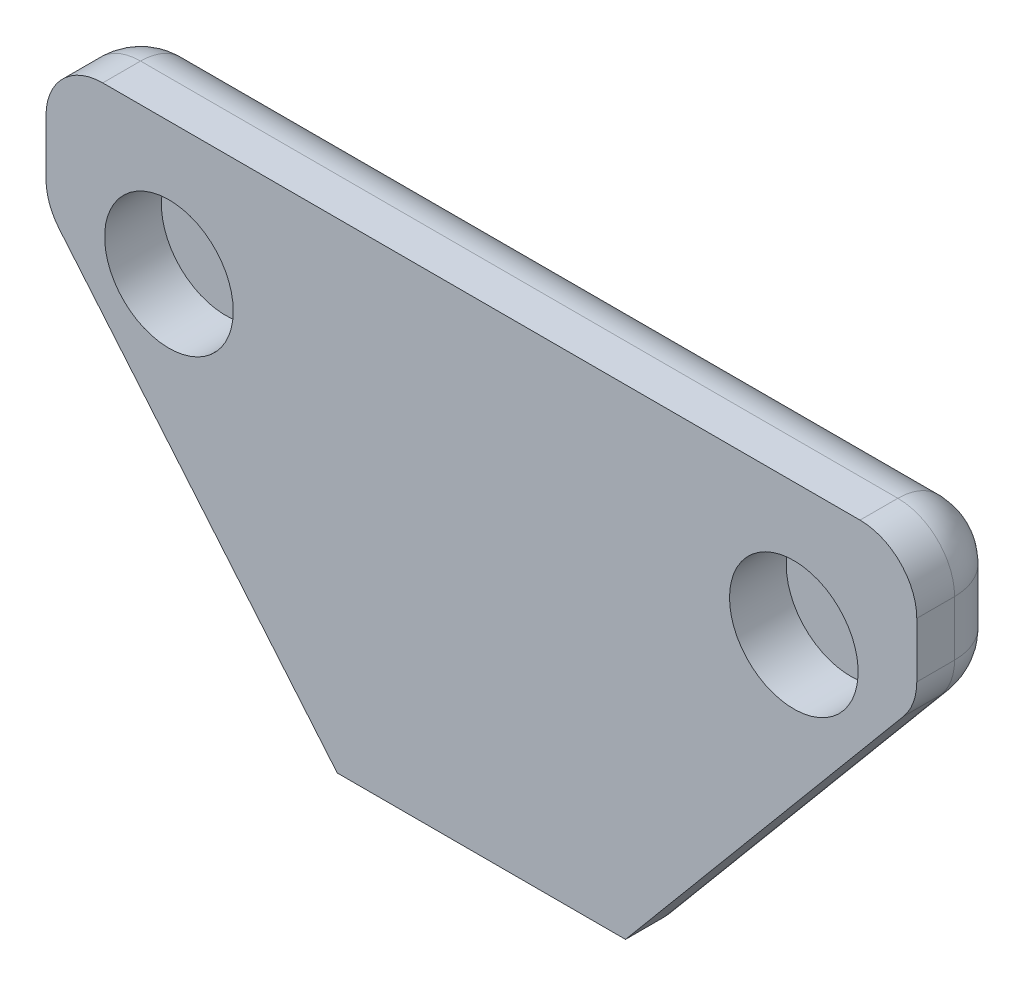
ISO-10303-21;
HEADER;
FILE_DESCRIPTION(('STEP AP214'),'2;1');
FILE_NAME('part.step','',(''),(''),'','','');
FILE_SCHEMA(('AUTOMOTIVE_DESIGN { 1 0 10303 214 1 1 1 1 }'));
ENDSEC;
DATA;
#1=APPLICATION_CONTEXT('core data for automotive mechanical design processes');
#2=APPLICATION_PROTOCOL_DEFINITION('international standard','automotive_design',2000,#1);
#3=PRODUCT_CONTEXT('',#1,'mechanical');
#4=PRODUCT('Part','Part','',(#3));
#5=PRODUCT_RELATED_PRODUCT_CATEGORY('part','',(#4));
#6=PRODUCT_DEFINITION_FORMATION('','',#4);
#7=PRODUCT_DEFINITION_CONTEXT('part definition',#1,'design');
#8=PRODUCT_DEFINITION('design','',#6,#7);
#9=PRODUCT_DEFINITION_SHAPE('','',#8);
#10=(LENGTH_UNIT() NAMED_UNIT(*) SI_UNIT(.MILLI.,.METRE.));
#11=(NAMED_UNIT(*) PLANE_ANGLE_UNIT() SI_UNIT($,.RADIAN.));
#12=(NAMED_UNIT(*) SI_UNIT($,.STERADIAN.) SOLID_ANGLE_UNIT());
#13=UNCERTAINTY_MEASURE_WITH_UNIT(LENGTH_MEASURE(1.E-05),#10,'distance_accuracy_value','');
#14=(GEOMETRIC_REPRESENTATION_CONTEXT(3) GLOBAL_UNCERTAINTY_ASSIGNED_CONTEXT((#13)) GLOBAL_UNIT_ASSIGNED_CONTEXT((#10,
#11,#12)) REPRESENTATION_CONTEXT('',''));
#15=CARTESIAN_POINT('',(0.,0.,0.));
#16=DIRECTION('',(0.,0.,1.));
#17=DIRECTION('',(1.,0.,0.));
#18=AXIS2_PLACEMENT_3D('',#15,#16,#17);
#19=CARTESIAN_POINT('',(5.44580381973494,12.7,2.5));
#20=DIRECTION('',(0.,-1.,0.));
#21=DIRECTION('',(1.,0.,0.));
#22=AXIS2_PLACEMENT_3D('',#19,#20,#21);
#23=PLANE('',#22);
#24=DIRECTION('',(-1.,0.,0.));
#25=VECTOR('',#24,1.);
#26=CARTESIAN_POINT('',(5.44580381973494,12.7,1.5));
#27=LINE('',#26,#25);
#28=CARTESIAN_POINT('',(15.4558038197349,12.7,1.5));
#29=VERTEX_POINT('',#28);
#30=CARTESIAN_POINT('',(-4.56419618026506,12.7,1.5));
#31=VERTEX_POINT('',#30);
#32=EDGE_CURVE('E268',#29,#31,#27,.T.);
#33=ORIENTED_EDGE('',*,*,#32,.T.);
#34=DIRECTION('',(0.,0.,-1.));
#35=VECTOR('',#34,1.);
#36=CARTESIAN_POINT('',(-4.56419618026506,12.7,2.5));
#37=LINE('',#36,#35);
#38=CARTESIAN_POINT('',(-4.56419618026506,12.7,2.5));
#39=VERTEX_POINT('',#38);
#40=EDGE_CURVE('E271',#31,#39,#37,.F.);
#41=ORIENTED_EDGE('',*,*,#40,.T.);
#42=DIRECTION('',(-1.,0.,0.));
#43=VECTOR('',#42,1.);
#44=CARTESIAN_POINT('',(5.44580381973494,12.7,2.5));
#45=LINE('',#44,#43);
#46=CARTESIAN_POINT('',(15.4558038197349,12.7,2.5));
#47=VERTEX_POINT('',#46);
#48=EDGE_CURVE('E243',#47,#39,#45,.T.);
#49=ORIENTED_EDGE('',*,*,#48,.F.);
#50=DIRECTION('',(0.,0.,-1.));
#51=VECTOR('',#50,1.);
#52=CARTESIAN_POINT('',(15.4558038197349,12.7,2.5));
#53=LINE('',#52,#51);
#54=EDGE_CURVE('E189',#29,#47,#53,.F.);
#55=ORIENTED_EDGE('',*,*,#54,.F.);
#56=EDGE_LOOP('',(#33,#41,#49,#55));
#57=FACE_BOUND('',#56,.T.);
#58=ADVANCED_FACE('F45',(#57),#23,.F.);
#59=CARTESIAN_POINT('',(-6.06419618026506,12.7,2.5));
#60=DIRECTION('',(1.,0.,0.));
#61=DIRECTION('',(0.,1.,0.));
#62=AXIS2_PLACEMENT_3D('',#59,#60,#61);
#63=PLANE('',#62);
#64=DIRECTION('',(0.,-1.,0.));
#65=VECTOR('',#64,1.);
#66=CARTESIAN_POINT('',(-6.06419618026506,12.7,2.5));
#67=LINE('',#66,#65);
#68=CARTESIAN_POINT('',(-6.06419618026506,11.2,2.5));
#69=VERTEX_POINT('',#68);
#70=CARTESIAN_POINT('',(-6.06419618026506,9.74488629456969,2.5));
#71=VERTEX_POINT('',#70);
#72=EDGE_CURVE('E250',#69,#71,#67,.T.);
#73=ORIENTED_EDGE('',*,*,#72,.F.);
#74=DIRECTION('',(0.,0.,-1.));
#75=VECTOR('',#74,1.);
#76=CARTESIAN_POINT('',(-6.06419618026506,11.2,2.5));
#77=LINE('',#76,#75);
#78=CARTESIAN_POINT('',(-6.06419618026506,11.2,1.5));
#79=VERTEX_POINT('',#78);
#80=EDGE_CURVE('E264',#69,#79,#77,.T.);
#81=ORIENTED_EDGE('',*,*,#80,.T.);
#82=DIRECTION('',(0.,-1.,0.));
#83=VECTOR('',#82,1.);
#84=CARTESIAN_POINT('',(-6.06419618026506,12.7,1.5));
#85=LINE('',#84,#83);
#86=CARTESIAN_POINT('',(-6.06419618026506,9.74488629456969,1.5));
#87=VERTEX_POINT('',#86);
#88=EDGE_CURVE('E258',#79,#87,#85,.T.);
#89=ORIENTED_EDGE('',*,*,#88,.T.);
#90=DIRECTION('',(0.,0.,-1.));
#91=VECTOR('',#90,1.);
#92=CARTESIAN_POINT('',(-6.06419618026506,9.74488629456969,2.5));
#93=LINE('',#92,#91);
#94=EDGE_CURVE('E261',#87,#71,#93,.F.);
#95=ORIENTED_EDGE('',*,*,#94,.T.);
#96=EDGE_LOOP('',(#73,#81,#89,#95));
#97=FACE_BOUND('',#96,.T.);
#98=ADVANCED_FACE('F357',(#97),#63,.F.);
#99=CARTESIAN_POINT('',(-6.06419618026506,9.19999999999999,2.5));
#100=DIRECTION('',(0.7668530772242,0.641822684198507,0.));
#101=DIRECTION('',(-0.641822684198507,0.7668530772242,0.));
#102=AXIS2_PLACEMENT_3D('',#99,#100,#101);
#103=PLANE('',#102);
#104=DIRECTION('',(0.641822684198507,-0.7668530772242,0.));
#105=VECTOR('',#104,1.);
#106=CARTESIAN_POINT('',(-6.06419618026506,9.19999999999999,2.5));
#107=LINE('',#106,#105);
#108=CARTESIAN_POINT('',(-5.71447579610135,8.78215226827193,2.5));
#109=VERTEX_POINT('',#108);
#110=CARTESIAN_POINT('',(1.63580381973484,0.,2.5));
#111=VERTEX_POINT('',#110);
#112=EDGE_CURVE('E147',#109,#111,#107,.T.);
#113=ORIENTED_EDGE('',*,*,#112,.F.);
#114=DIRECTION('',(0.,0.,-1.));
#115=VECTOR('',#114,1.);
#116=CARTESIAN_POINT('',(-5.71447579610135,8.78215226827193,2.5));
#117=LINE('',#116,#115);
#118=CARTESIAN_POINT('',(-5.71447579610135,8.78215226827193,1.5));
#119=VERTEX_POINT('',#118);
#120=EDGE_CURVE('E283',#109,#119,#117,.T.);
#121=ORIENTED_EDGE('',*,*,#120,.T.);
#122=DIRECTION('',(0.641822684198507,-0.7668530772242,0.));
#123=VECTOR('',#122,1.);
#124=CARTESIAN_POINT('',(-6.06419618026506,9.19999999999999,1.5));
#125=LINE('',#124,#123);
#126=CARTESIAN_POINT('',(1.63580381973484,0.,1.5));
#127=VERTEX_POINT('',#126);
#128=EDGE_CURVE('E280',#119,#127,#125,.T.);
#129=ORIENTED_EDGE('',*,*,#128,.T.);
#130=DIRECTION('',(0.,0.,-1.));
#131=VECTOR('',#130,1.);
#132=CARTESIAN_POINT('',(1.63580381973484,0.,2.5));
#133=LINE('',#132,#131);
#134=EDGE_CURVE('E152',#111,#127,#133,.T.);
#135=ORIENTED_EDGE('',*,*,#134,.F.);
#136=EDGE_LOOP('',(#113,#121,#129,#135));
#137=FACE_BOUND('',#136,.T.);
#138=ADVANCED_FACE('F365',(#137),#103,.F.);
#139=CARTESIAN_POINT('',(5.44580381973494,0.,2.5));
#140=DIRECTION('',(0.,1.,0.));
#141=DIRECTION('',(-1.,0.,0.));
#142=AXIS2_PLACEMENT_3D('',#139,#140,#141);
#143=PLANE('',#142);
#144=ORIENTED_EDGE('',*,*,#134,.T.);
#145=DIRECTION('',(1.,0.,0.));
#146=VECTOR('',#145,1.);
#147=CARTESIAN_POINT('',(5.44580381973494,0.,1.5));
#148=LINE('',#147,#146);
#149=CARTESIAN_POINT('',(9.25580381973505,0.,1.5));
#150=VERTEX_POINT('',#149);
#151=EDGE_CURVE('E158',#127,#150,#148,.T.);
#152=ORIENTED_EDGE('',*,*,#151,.T.);
#153=DIRECTION('',(0.,0.,-1.));
#154=VECTOR('',#153,1.);
#155=CARTESIAN_POINT('',(9.25580381973505,0.,2.5));
#156=LINE('',#155,#154);
#157=CARTESIAN_POINT('',(9.25580381973505,0.,2.5));
#158=VERTEX_POINT('',#157);
#159=EDGE_CURVE('E155',#158,#150,#156,.T.);
#160=ORIENTED_EDGE('',*,*,#159,.F.);
#161=DIRECTION('',(1.,0.,0.));
#162=VECTOR('',#161,1.);
#163=CARTESIAN_POINT('',(5.44580381973494,0.,2.5));
#164=LINE('',#163,#162);
#165=EDGE_CURVE('E139',#111,#158,#164,.T.);
#166=ORIENTED_EDGE('',*,*,#165,.F.);
#167=EDGE_LOOP('',(#144,#152,#160,#166));
#168=FACE_BOUND('',#167,.T.);
#169=ADVANCED_FACE('F156',(#168),#143,.F.);
#170=CARTESIAN_POINT('',(0.,0.,2.5));
#171=DIRECTION('',(0.,0.,1.));
#172=DIRECTION('',(1.,0.,0.));
#173=AXIS2_PLACEMENT_3D('',#170,#171,#172);
#174=PLANE('',#173);
#175=CARTESIAN_POINT('',(-2.81419618026506,9.2,2.5));
#176=DIRECTION('',(0.,0.,1.));
#177=DIRECTION('',(1.,0.,0.));
#178=AXIS2_PLACEMENT_3D('',#175,#176,#177);
#179=CIRCLE('',#178,1.7);
#180=CARTESIAN_POINT('',(-1.11419618026506,9.2,2.5));
#181=VERTEX_POINT('',#180);
#182=EDGE_CURVE('E244',#181,#181,#179,.T.);
#183=ORIENTED_EDGE('',*,*,#182,.F.);
#184=EDGE_LOOP('',(#183));
#185=FACE_BOUND('',#184,.T.);
#186=ORIENTED_EDGE('',*,*,#48,.T.);
#187=CARTESIAN_POINT('',(-4.56419618026506,11.2,2.5));
#188=DIRECTION('',(0.,0.,1.));
#189=DIRECTION('',(1.,0.,0.));
#190=AXIS2_PLACEMENT_3D('',#187,#188,#189);
#191=CIRCLE('',#190,1.5);
#192=EDGE_CURVE('E277',#39,#69,#191,.T.);
#193=ORIENTED_EDGE('',*,*,#192,.T.);
#194=ORIENTED_EDGE('',*,*,#72,.T.);
#195=CARTESIAN_POINT('',(-4.56419618026506,9.74488629456969,2.5));
#196=DIRECTION('',(0.,0.,1.));
#197=DIRECTION('',(1.,0.,0.));
#198=AXIS2_PLACEMENT_3D('',#195,#196,#197);
#199=CIRCLE('',#198,1.5);
#200=EDGE_CURVE('E274',#71,#109,#199,.T.);
#201=ORIENTED_EDGE('',*,*,#200,.T.);
#202=ORIENTED_EDGE('',*,*,#112,.T.);
#203=ORIENTED_EDGE('',*,*,#165,.T.);
#204=DIRECTION('',(-0.641822684198506,-0.7668530772242,0.));
#205=VECTOR('',#204,1.);
#206=CARTESIAN_POINT('',(16.9558038197349,9.19999999999999,2.5));
#207=LINE('',#206,#205);
#208=CARTESIAN_POINT('',(16.6060834355712,8.78215226827193,2.5));
#209=VERTEX_POINT('',#208);
#210=EDGE_CURVE('E145',#209,#158,#207,.T.);
#211=ORIENTED_EDGE('',*,*,#210,.F.);
#212=CARTESIAN_POINT('',(15.4558038197349,9.74488629456969,2.5));
#213=DIRECTION('',(0.,0.,-1.));
#214=DIRECTION('',(-1.,0.,0.));
#215=AXIS2_PLACEMENT_3D('',#212,#213,#214);
#216=CIRCLE('',#215,1.5);
#217=CARTESIAN_POINT('',(16.9558038197349,9.74488629456969,2.5));
#218=VERTEX_POINT('',#217);
#219=EDGE_CURVE('E193',#218,#209,#216,.T.);
#220=ORIENTED_EDGE('',*,*,#219,.F.);
#221=DIRECTION('',(0.,-1.,0.));
#222=VECTOR('',#221,1.);
#223=CARTESIAN_POINT('',(16.9558038197349,12.7,2.5));
#224=LINE('',#223,#222);
#225=CARTESIAN_POINT('',(16.9558038197349,11.2,2.5));
#226=VERTEX_POINT('',#225);
#227=EDGE_CURVE('E170',#226,#218,#224,.T.);
#228=ORIENTED_EDGE('',*,*,#227,.F.);
#229=CARTESIAN_POINT('',(15.4558038197349,11.2,2.5));
#230=DIRECTION('',(0.,0.,-1.));
#231=DIRECTION('',(-1.,0.,0.));
#232=AXIS2_PLACEMENT_3D('',#229,#230,#231);
#233=CIRCLE('',#232,1.5);
#234=EDGE_CURVE('E196',#47,#226,#233,.T.);
#235=ORIENTED_EDGE('',*,*,#234,.F.);
#236=EDGE_LOOP('',(#186,#193,#194,#201,#202,#203,#211,#220,#228,#235));
#237=FACE_BOUND('',#236,.T.);
#238=CARTESIAN_POINT('',(13.7058038197349,9.2,2.5));
#239=DIRECTION('',(0.,0.,-1.));
#240=DIRECTION('',(-1.,0.,0.));
#241=AXIS2_PLACEMENT_3D('',#238,#239,#240);
#242=CIRCLE('',#241,1.7);
#243=CARTESIAN_POINT('',(12.0058038197349,9.2,2.5));
#244=VERTEX_POINT('',#243);
#245=EDGE_CURVE('E238',#244,#244,#242,.T.);
#246=ORIENTED_EDGE('',*,*,#245,.T.);
#247=EDGE_LOOP('',(#246));
#248=FACE_BOUND('',#247,.T.);
#249=ADVANCED_FACE('F142',(#185,#237,#248),#174,.T.);
#250=CARTESIAN_POINT('',(0.,0.,0.));
#251=DIRECTION('',(0.,0.,1.));
#252=DIRECTION('',(1.,0.,0.));
#253=AXIS2_PLACEMENT_3D('',#250,#251,#252);
#254=PLANE('',#253);
#255=DIRECTION('',(-1.,0.,0.));
#256=VECTOR('',#255,1.);
#257=CARTESIAN_POINT('',(0.,11.2,0.));
#258=LINE('',#257,#256);
#259=CARTESIAN_POINT('',(-4.56419618026506,11.2,0.));
#260=VERTEX_POINT('',#259);
#261=CARTESIAN_POINT('',(15.4558038197349,11.2,0.));
#262=VERTEX_POINT('',#261);
#263=EDGE_CURVE('E288',#260,#262,#258,.F.);
#264=ORIENTED_EDGE('',*,*,#263,.T.);
#265=DIRECTION('',(0.,-1.,0.));
#266=VECTOR('',#265,1.);
#267=CARTESIAN_POINT('',(15.4558038197349,0.,0.));
#268=LINE('',#267,#266);
#269=CARTESIAN_POINT('',(15.4558038197349,9.74488629456969,0.));
#270=VERTEX_POINT('',#269);
#271=EDGE_CURVE('E205',#270,#262,#268,.F.);
#272=ORIENTED_EDGE('',*,*,#271,.F.);
#273=DIRECTION('',(-0.641822684198506,-0.7668530772242,0.));
#274=VECTOR('',#273,1.);
#275=CARTESIAN_POINT('',(8.77937127172392,1.76785000343953,0.));
#276=LINE('',#275,#274);
#277=CARTESIAN_POINT('',(8.55519246449736,1.5,0.));
#278=VERTEX_POINT('',#277);
#279=EDGE_CURVE('E209',#278,#270,#276,.F.);
#280=ORIENTED_EDGE('',*,*,#279,.F.);
#281=DIRECTION('',(1.,0.,0.));
#282=VECTOR('',#281,1.);
#283=CARTESIAN_POINT('',(0.,1.5,0.));
#284=LINE('',#283,#282);
#285=CARTESIAN_POINT('',(2.33641517497253,1.5,0.));
#286=VERTEX_POINT('',#285);
#287=EDGE_CURVE('E11',#278,#286,#284,.F.);
#288=ORIENTED_EDGE('',*,*,#287,.T.);
#289=DIRECTION('',(0.641822684198507,-0.7668530772242,0.));
#290=VECTOR('',#289,1.);
#291=CARTESIAN_POINT('',(2.11223636774596,1.76785000343953,0.));
#292=LINE('',#291,#290);
#293=CARTESIAN_POINT('',(-4.56419618026506,9.74488629456969,0.));
#294=VERTEX_POINT('',#293);
#295=EDGE_CURVE('E55',#286,#294,#292,.F.);
#296=ORIENTED_EDGE('',*,*,#295,.T.);
#297=DIRECTION('',(0.,-1.,0.));
#298=VECTOR('',#297,1.);
#299=CARTESIAN_POINT('',(-4.56419618026505,0.,0.));
#300=LINE('',#299,#298);
#301=EDGE_CURVE('E291',#294,#260,#300,.F.);
#302=ORIENTED_EDGE('',*,*,#301,.T.);
#303=EDGE_LOOP('',(#264,#272,#280,#288,#296,#302));
#304=FACE_BOUND('',#303,.T.);
#305=ADVANCED_FACE('F411',(#304),#254,.F.);
#306=CARTESIAN_POINT('',(-2.81419618026506,9.2,1.));
#307=DIRECTION('',(0.,0.,1.));
#308=DIRECTION('',(1.,0.,0.));
#309=AXIS2_PLACEMENT_3D('',#306,#307,#308);
#310=CYLINDRICAL_SURFACE('',#309,1.7);
#311=CARTESIAN_POINT('',(-2.81419618026506,9.2,1.));
#312=DIRECTION('',(0.,0.,1.));
#313=DIRECTION('',(1.,0.,0.));
#314=AXIS2_PLACEMENT_3D('',#311,#312,#313);
#315=CIRCLE('',#314,1.7);
#316=CARTESIAN_POINT('',(-1.11419618026506,9.2,1.));
#317=VERTEX_POINT('',#316);
#318=EDGE_CURVE('E239',#317,#317,#315,.T.);
#319=ORIENTED_EDGE('',*,*,#318,.F.);
#320=EDGE_LOOP('',(#319));
#321=FACE_BOUND('',#320,.T.);
#322=ORIENTED_EDGE('',*,*,#182,.T.);
#323=EDGE_LOOP('',(#322));
#324=FACE_BOUND('',#323,.T.);
#325=ADVANCED_FACE('F405',(#321,#324),#310,.F.);
#326=CARTESIAN_POINT('',(-2.81419618026506,9.2,1.));
#327=DIRECTION('',(0.,0.,1.));
#328=DIRECTION('',(1.,0.,0.));
#329=AXIS2_PLACEMENT_3D('',#326,#327,#328);
#330=PLANE('',#329);
#331=ORIENTED_EDGE('',*,*,#318,.T.);
#332=EDGE_LOOP('',(#331));
#333=FACE_BOUND('',#332,.T.);
#334=ADVANCED_FACE('F401',(#333),#330,.T.);
#335=CARTESIAN_POINT('',(5.44580381973494,1.5,1.5));
#336=DIRECTION('',(1.,0.,0.));
#337=DIRECTION('',(0.,1.,0.));
#338=AXIS2_PLACEMENT_3D('',#335,#336,#337);
#339=CYLINDRICAL_SURFACE('',#338,1.5);
#340=ORIENTED_EDGE('',*,*,#287,.F.);
#341=CARTESIAN_POINT('',(8.55519246449736,1.5,1.5));
#342=DIRECTION('',(0.906041578570903,0.423188678842838,0.));
#343=DIRECTION('',(0.423188678842838,-0.906041578570903,0.));
#344=AXIS2_PLACEMENT_3D('',#341,#342,#343);
#345=ELLIPSE('',#344,1.65555316166168,1.5);
#346=EDGE_CURVE('E235',#278,#150,#345,.F.);
#347=ORIENTED_EDGE('',*,*,#346,.T.);
#348=ORIENTED_EDGE('',*,*,#151,.F.);
#349=CARTESIAN_POINT('',(2.33641517497253,1.5,1.5));
#350=DIRECTION('',(0.906041578570903,-0.423188678842838,0.));
#351=DIRECTION('',(-0.423188678842838,-0.906041578570903,0.));
#352=AXIS2_PLACEMENT_3D('',#349,#350,#351);
#353=ELLIPSE('',#352,1.65555316166168,1.5);
#354=EDGE_CURVE('E49',#286,#127,#353,.F.);
#355=ORIENTED_EDGE('',*,*,#354,.F.);
#356=EDGE_LOOP('',(#340,#347,#348,#355));
#357=FACE_BOUND('',#356,.T.);
#358=ADVANCED_FACE('F47',(#357),#339,.T.);
#359=CARTESIAN_POINT('',(-4.56419618026506,9.74488629456969,2.5));
#360=DIRECTION('',(0.,0.,-1.));
#361=DIRECTION('',(-1.,0.,0.));
#362=AXIS2_PLACEMENT_3D('',#359,#360,#361);
#363=CYLINDRICAL_SURFACE('',#362,1.5);
#364=ORIENTED_EDGE('',*,*,#200,.F.);
#365=ORIENTED_EDGE('',*,*,#94,.F.);
#366=CARTESIAN_POINT('',(-4.56419618026505,9.74488629456969,1.5));
#367=DIRECTION('',(0.,0.,-1.));
#368=DIRECTION('',(-1.,0.,0.));
#369=AXIS2_PLACEMENT_3D('',#366,#367,#368);
#370=CIRCLE('',#369,1.5);
#371=EDGE_CURVE('E313',#119,#87,#370,.T.);
#372=ORIENTED_EDGE('',*,*,#371,.F.);
#373=ORIENTED_EDGE('',*,*,#120,.F.);
#374=EDGE_LOOP('',(#364,#365,#372,#373));
#375=FACE_BOUND('',#374,.T.);
#376=ADVANCED_FACE('F363',(#375),#363,.T.);
#377=CARTESIAN_POINT('',(-4.91391656442876,10.1627340262978,1.5));
#378=DIRECTION('',(0.641822684198507,-0.7668530772242,0.));
#379=DIRECTION('',(0.7668530772242,0.641822684198507,0.));
#380=AXIS2_PLACEMENT_3D('',#377,#378,#379);
#381=CYLINDRICAL_SURFACE('',#380,1.5);
#382=ORIENTED_EDGE('',*,*,#354,.T.);
#383=ORIENTED_EDGE('',*,*,#128,.F.);
#384=CARTESIAN_POINT('',(-4.56419618026506,9.74488629456969,1.5));
#385=DIRECTION('',(-0.641822684198506,0.7668530772242,0.));
#386=DIRECTION('',(-0.7668530772242,-0.641822684198506,0.));
#387=AXIS2_PLACEMENT_3D('',#384,#385,#386);
#388=CIRCLE('',#387,1.5);
#389=EDGE_CURVE('E310',#294,#119,#388,.T.);
#390=ORIENTED_EDGE('',*,*,#389,.F.);
#391=ORIENTED_EDGE('',*,*,#295,.F.);
#392=EDGE_LOOP('',(#382,#383,#390,#391));
#393=FACE_BOUND('',#392,.T.);
#394=ADVANCED_FACE('F323',(#393),#381,.T.);
#395=CARTESIAN_POINT('',(-4.56419618026506,9.74488629456969,1.5));
#396=DIRECTION('',(0.,0.,-1.));
#397=DIRECTION('',(-1.,0.,0.));
#398=AXIS2_PLACEMENT_3D('',#395,#396,#397);
#399=SPHERICAL_SURFACE('',#398,1.5);
#400=ORIENTED_EDGE('',*,*,#389,.T.);
#401=ORIENTED_EDGE('',*,*,#371,.T.);
#402=CARTESIAN_POINT('',(-4.56419618026506,9.74488629456969,1.5));
#403=DIRECTION('',(0.,-1.,0.));
#404=DIRECTION('',(0.,0.,-1.));
#405=AXIS2_PLACEMENT_3D('',#402,#403,#404);
#406=CIRCLE('',#405,1.5);
#407=EDGE_CURVE('E306',#294,#87,#406,.F.);
#408=ORIENTED_EDGE('',*,*,#407,.F.);
#409=EDGE_LOOP('',(#400,#401,#408));
#410=FACE_BOUND('',#409,.T.);
#411=ADVANCED_FACE('F392',(#410),#399,.T.);
#412=CARTESIAN_POINT('',(-4.56419618026506,12.7,1.5));
#413=DIRECTION('',(0.,-1.,0.));
#414=DIRECTION('',(1.,0.,0.));
#415=AXIS2_PLACEMENT_3D('',#412,#413,#414);
#416=CYLINDRICAL_SURFACE('',#415,1.5);
#417=ORIENTED_EDGE('',*,*,#407,.T.);
#418=ORIENTED_EDGE('',*,*,#88,.F.);
#419=CARTESIAN_POINT('',(-4.56419618026506,11.2,1.5));
#420=DIRECTION('',(0.,1.,0.));
#421=DIRECTION('',(0.,0.,1.));
#422=AXIS2_PLACEMENT_3D('',#419,#420,#421);
#423=CIRCLE('',#422,1.5);
#424=EDGE_CURVE('E302',#260,#79,#423,.T.);
#425=ORIENTED_EDGE('',*,*,#424,.F.);
#426=ORIENTED_EDGE('',*,*,#301,.F.);
#427=EDGE_LOOP('',(#417,#418,#425,#426));
#428=FACE_BOUND('',#427,.T.);
#429=ADVANCED_FACE('F388',(#428),#416,.T.);
#430=CARTESIAN_POINT('',(5.44580381973494,11.2,1.5));
#431=DIRECTION('',(-1.,0.,0.));
#432=DIRECTION('',(0.,-1.,0.));
#433=AXIS2_PLACEMENT_3D('',#430,#431,#432);
#434=CYLINDRICAL_SURFACE('',#433,1.5);
#435=ORIENTED_EDGE('',*,*,#32,.F.);
#436=CARTESIAN_POINT('',(15.4558038197349,11.2,1.5));
#437=DIRECTION('',(-1.,0.,0.));
#438=DIRECTION('',(0.,0.,1.));
#439=AXIS2_PLACEMENT_3D('',#436,#437,#438);
#440=CIRCLE('',#439,1.5);
#441=EDGE_CURVE('E217',#29,#262,#440,.T.);
#442=ORIENTED_EDGE('',*,*,#441,.T.);
#443=ORIENTED_EDGE('',*,*,#263,.F.);
#444=CARTESIAN_POINT('',(-4.56419618026506,11.2,1.5));
#445=DIRECTION('',(-1.,0.,0.));
#446=DIRECTION('',(0.,0.,1.));
#447=AXIS2_PLACEMENT_3D('',#444,#445,#446);
#448=CIRCLE('',#447,1.5);
#449=EDGE_CURVE('E298',#31,#260,#448,.T.);
#450=ORIENTED_EDGE('',*,*,#449,.F.);
#451=EDGE_LOOP('',(#435,#442,#443,#450));
#452=FACE_BOUND('',#451,.T.);
#453=ADVANCED_FACE('F384',(#452),#434,.T.);
#454=CARTESIAN_POINT('',(-4.56419618026506,11.2,1.5));
#455=DIRECTION('',(0.,0.,-1.));
#456=DIRECTION('',(-1.,0.,0.));
#457=AXIS2_PLACEMENT_3D('',#454,#455,#456);
#458=SPHERICAL_SURFACE('',#457,1.5);
#459=ORIENTED_EDGE('',*,*,#449,.T.);
#460=ORIENTED_EDGE('',*,*,#424,.T.);
#461=CARTESIAN_POINT('',(-4.56419618026506,11.2,1.5));
#462=DIRECTION('',(0.,0.,-1.));
#463=DIRECTION('',(-1.,0.,0.));
#464=AXIS2_PLACEMENT_3D('',#461,#462,#463);
#465=CIRCLE('',#464,1.5);
#466=EDGE_CURVE('E213',#31,#79,#465,.F.);
#467=ORIENTED_EDGE('',*,*,#466,.F.);
#468=EDGE_LOOP('',(#459,#460,#467));
#469=FACE_BOUND('',#468,.T.);
#470=ADVANCED_FACE('F381',(#469),#458,.T.);
#471=CARTESIAN_POINT('',(-4.56419618026506,11.2,2.5));
#472=DIRECTION('',(0.,0.,-1.));
#473=DIRECTION('',(-1.,0.,0.));
#474=AXIS2_PLACEMENT_3D('',#471,#472,#473);
#475=CYLINDRICAL_SURFACE('',#474,1.5);
#476=ORIENTED_EDGE('',*,*,#192,.F.);
#477=ORIENTED_EDGE('',*,*,#40,.F.);
#478=ORIENTED_EDGE('',*,*,#466,.T.);
#479=ORIENTED_EDGE('',*,*,#80,.F.);
#480=EDGE_LOOP('',(#476,#477,#478,#479));
#481=FACE_BOUND('',#480,.T.);
#482=ADVANCED_FACE('F354',(#481),#475,.T.);
#483=CARTESIAN_POINT('',(16.9558038197349,12.7,2.5));
#484=DIRECTION('',(-1.,0.,0.));
#485=DIRECTION('',(0.,1.,0.));
#486=AXIS2_PLACEMENT_3D('',#483,#484,#485);
#487=PLANE('',#486);
#488=ORIENTED_EDGE('',*,*,#227,.T.);
#489=DIRECTION('',(0.,0.,-1.));
#490=VECTOR('',#489,1.);
#491=CARTESIAN_POINT('',(16.9558038197349,9.74488629456969,2.5));
#492=LINE('',#491,#490);
#493=CARTESIAN_POINT('',(16.9558038197349,9.74488629456969,1.5));
#494=VERTEX_POINT('',#493);
#495=EDGE_CURVE('E181',#494,#218,#492,.F.);
#496=ORIENTED_EDGE('',*,*,#495,.F.);
#497=DIRECTION('',(0.,-1.,0.));
#498=VECTOR('',#497,1.);
#499=CARTESIAN_POINT('',(16.9558038197349,12.7,1.5));
#500=LINE('',#499,#498);
#501=CARTESIAN_POINT('',(16.9558038197349,11.2,1.5));
#502=VERTEX_POINT('',#501);
#503=EDGE_CURVE('E163',#502,#494,#500,.T.);
#504=ORIENTED_EDGE('',*,*,#503,.F.);
#505=DIRECTION('',(0.,0.,-1.));
#506=VECTOR('',#505,1.);
#507=CARTESIAN_POINT('',(16.9558038197349,11.2,2.5));
#508=LINE('',#507,#506);
#509=EDGE_CURVE('E185',#226,#502,#508,.T.);
#510=ORIENTED_EDGE('',*,*,#509,.F.);
#511=EDGE_LOOP('',(#488,#496,#504,#510));
#512=FACE_BOUND('',#511,.T.);
#513=ADVANCED_FACE('F340',(#512),#487,.F.);
#514=CARTESIAN_POINT('',(16.9558038197349,9.19999999999999,2.5));
#515=DIRECTION('',(-0.7668530772242,0.641822684198506,0.));
#516=DIRECTION('',(0.641822684198506,0.7668530772242,0.));
#517=AXIS2_PLACEMENT_3D('',#514,#515,#516);
#518=PLANE('',#517);
#519=ORIENTED_EDGE('',*,*,#210,.T.);
#520=ORIENTED_EDGE('',*,*,#159,.T.);
#521=DIRECTION('',(-0.641822684198506,-0.7668530772242,0.));
#522=VECTOR('',#521,1.);
#523=CARTESIAN_POINT('',(16.9558038197349,9.19999999999999,1.5));
#524=LINE('',#523,#522);
#525=CARTESIAN_POINT('',(16.6060834355712,8.78215226827193,1.5));
#526=VERTEX_POINT('',#525);
#527=EDGE_CURVE('E199',#526,#150,#524,.T.);
#528=ORIENTED_EDGE('',*,*,#527,.F.);
#529=DIRECTION('',(0.,0.,-1.));
#530=VECTOR('',#529,1.);
#531=CARTESIAN_POINT('',(16.6060834355712,8.78215226827193,2.5));
#532=LINE('',#531,#530);
#533=EDGE_CURVE('E168',#209,#526,#532,.T.);
#534=ORIENTED_EDGE('',*,*,#533,.F.);
#535=EDGE_LOOP('',(#519,#520,#528,#534));
#536=FACE_BOUND('',#535,.T.);
#537=ADVANCED_FACE('F166',(#536),#518,.F.);
#538=CARTESIAN_POINT('',(13.7058038197349,9.2,1.));
#539=DIRECTION('',(0.,0.,1.));
#540=DIRECTION('',(-1.,0.,0.));
#541=AXIS2_PLACEMENT_3D('',#538,#539,#540);
#542=CYLINDRICAL_SURFACE('',#541,1.7);
#543=CARTESIAN_POINT('',(13.7058038197349,9.2,1.));
#544=DIRECTION('',(0.,0.,-1.));
#545=DIRECTION('',(-1.,0.,0.));
#546=AXIS2_PLACEMENT_3D('',#543,#544,#545);
#547=CIRCLE('',#546,1.7);
#548=CARTESIAN_POINT('',(12.0058038197349,9.2,1.));
#549=VERTEX_POINT('',#548);
#550=EDGE_CURVE('E174',#549,#549,#547,.T.);
#551=ORIENTED_EDGE('',*,*,#550,.T.);
#552=EDGE_LOOP('',(#551));
#553=FACE_BOUND('',#552,.T.);
#554=ORIENTED_EDGE('',*,*,#245,.F.);
#555=EDGE_LOOP('',(#554));
#556=FACE_BOUND('',#555,.T.);
#557=ADVANCED_FACE('F448',(#553,#556),#542,.F.);
#558=CARTESIAN_POINT('',(13.7058038197349,9.2,1.));
#559=DIRECTION('',(0.,0.,1.));
#560=DIRECTION('',(-1.,0.,0.));
#561=AXIS2_PLACEMENT_3D('',#558,#559,#560);
#562=PLANE('',#561);
#563=ORIENTED_EDGE('',*,*,#550,.F.);
#564=EDGE_LOOP('',(#563));
#565=FACE_BOUND('',#564,.T.);
#566=ADVANCED_FACE('F444',(#565),#562,.T.);
#567=CARTESIAN_POINT('',(15.4558038197349,9.74488629456969,2.5));
#568=DIRECTION('',(0.,0.,-1.));
#569=DIRECTION('',(1.,0.,0.));
#570=AXIS2_PLACEMENT_3D('',#567,#568,#569);
#571=CYLINDRICAL_SURFACE('',#570,1.5);
#572=ORIENTED_EDGE('',*,*,#219,.T.);
#573=ORIENTED_EDGE('',*,*,#533,.T.);
#574=CARTESIAN_POINT('',(15.4558038197349,9.74488629456969,1.5));
#575=DIRECTION('',(0.,0.,1.));
#576=DIRECTION('',(1.,0.,0.));
#577=AXIS2_PLACEMENT_3D('',#574,#575,#576);
#578=CIRCLE('',#577,1.5);
#579=EDGE_CURVE('E231',#526,#494,#578,.T.);
#580=ORIENTED_EDGE('',*,*,#579,.T.);
#581=ORIENTED_EDGE('',*,*,#495,.T.);
#582=EDGE_LOOP('',(#572,#573,#580,#581));
#583=FACE_BOUND('',#582,.T.);
#584=ADVANCED_FACE('F334',(#583),#571,.T.);
#585=CARTESIAN_POINT('',(15.8055242038986,10.1627340262978,1.5));
#586=DIRECTION('',(-0.641822684198506,-0.7668530772242,0.));
#587=DIRECTION('',(-0.7668530772242,0.641822684198506,0.));
#588=AXIS2_PLACEMENT_3D('',#585,#586,#587);
#589=CYLINDRICAL_SURFACE('',#588,1.5);
#590=ORIENTED_EDGE('',*,*,#346,.F.);
#591=ORIENTED_EDGE('',*,*,#279,.T.);
#592=CARTESIAN_POINT('',(15.4558038197349,9.74488629456969,1.5));
#593=DIRECTION('',(-0.641822684198506,-0.7668530772242,0.));
#594=DIRECTION('',(0.7668530772242,-0.641822684198506,0.));
#595=AXIS2_PLACEMENT_3D('',#592,#593,#594);
#596=CIRCLE('',#595,1.5);
#597=EDGE_CURVE('E228',#270,#526,#596,.T.);
#598=ORIENTED_EDGE('',*,*,#597,.T.);
#599=ORIENTED_EDGE('',*,*,#527,.T.);
#600=EDGE_LOOP('',(#590,#591,#598,#599));
#601=FACE_BOUND('',#600,.T.);
#602=ADVANCED_FACE('F327',(#601),#589,.T.);
#603=CARTESIAN_POINT('',(15.4558038197349,9.74488629456969,1.5));
#604=DIRECTION('',(0.,0.,-1.));
#605=DIRECTION('',(1.,0.,0.));
#606=AXIS2_PLACEMENT_3D('',#603,#604,#605);
#607=SPHERICAL_SURFACE('',#606,1.5);
#608=ORIENTED_EDGE('',*,*,#597,.F.);
#609=CARTESIAN_POINT('',(15.4558038197349,9.74488629456969,1.5));
#610=DIRECTION('',(0.,1.,0.));
#611=DIRECTION('',(0.,0.,-1.));
#612=AXIS2_PLACEMENT_3D('',#609,#610,#611);
#613=CIRCLE('',#612,1.5);
#614=EDGE_CURVE('E225',#270,#494,#613,.F.);
#615=ORIENTED_EDGE('',*,*,#614,.T.);
#616=ORIENTED_EDGE('',*,*,#579,.F.);
#617=EDGE_LOOP('',(#608,#615,#616));
#618=FACE_BOUND('',#617,.T.);
#619=ADVANCED_FACE('F332',(#618),#607,.T.);
#620=CARTESIAN_POINT('',(15.4558038197349,12.7,1.5));
#621=DIRECTION('',(0.,-1.,0.));
#622=DIRECTION('',(-1.,0.,0.));
#623=AXIS2_PLACEMENT_3D('',#620,#621,#622);
#624=CYLINDRICAL_SURFACE('',#623,1.5);
#625=ORIENTED_EDGE('',*,*,#614,.F.);
#626=ORIENTED_EDGE('',*,*,#271,.T.);
#627=CARTESIAN_POINT('',(15.4558038197349,11.2,1.5));
#628=DIRECTION('',(0.,-1.,0.));
#629=DIRECTION('',(0.,0.,1.));
#630=AXIS2_PLACEMENT_3D('',#627,#628,#629);
#631=CIRCLE('',#630,1.5);
#632=EDGE_CURVE('E221',#262,#502,#631,.T.);
#633=ORIENTED_EDGE('',*,*,#632,.T.);
#634=ORIENTED_EDGE('',*,*,#503,.T.);
#635=EDGE_LOOP('',(#625,#626,#633,#634));
#636=FACE_BOUND('',#635,.T.);
#637=ADVANCED_FACE('F430',(#636),#624,.T.);
#638=CARTESIAN_POINT('',(15.4558038197349,11.2,1.5));
#639=DIRECTION('',(0.,0.,-1.));
#640=DIRECTION('',(1.,0.,0.));
#641=AXIS2_PLACEMENT_3D('',#638,#639,#640);
#642=SPHERICAL_SURFACE('',#641,1.5);
#643=ORIENTED_EDGE('',*,*,#441,.F.);
#644=CARTESIAN_POINT('',(15.4558038197349,11.2,1.5));
#645=DIRECTION('',(0.,0.,1.));
#646=DIRECTION('',(1.,0.,0.));
#647=AXIS2_PLACEMENT_3D('',#644,#645,#646);
#648=CIRCLE('',#647,1.5);
#649=EDGE_CURVE('E214',#29,#502,#648,.F.);
#650=ORIENTED_EDGE('',*,*,#649,.T.);
#651=ORIENTED_EDGE('',*,*,#632,.F.);
#652=EDGE_LOOP('',(#643,#650,#651));
#653=FACE_BOUND('',#652,.T.);
#654=ADVANCED_FACE('F428',(#653),#642,.T.);
#655=CARTESIAN_POINT('',(15.4558038197349,11.2,2.5));
#656=DIRECTION('',(0.,0.,-1.));
#657=DIRECTION('',(1.,0.,0.));
#658=AXIS2_PLACEMENT_3D('',#655,#656,#657);
#659=CYLINDRICAL_SURFACE('',#658,1.5);
#660=ORIENTED_EDGE('',*,*,#234,.T.);
#661=ORIENTED_EDGE('',*,*,#509,.T.);
#662=ORIENTED_EDGE('',*,*,#649,.F.);
#663=ORIENTED_EDGE('',*,*,#54,.T.);
#664=EDGE_LOOP('',(#660,#661,#662,#663));
#665=FACE_BOUND('',#664,.T.);
#666=ADVANCED_FACE('F344',(#665),#659,.T.);
#667=CLOSED_SHELL('',(#58,#98,#138,#169,#249,#305,#325,#334,#358,#376,#394,#411,#429,#453,#470,
#482,#513,#537,#557,#566,#584,#602,#619,#637,#654,#666));
#668=MANIFOLD_SOLID_BREP('B2',#667);
#669=ADVANCED_BREP_SHAPE_REPRESENTATION('',(#18,#668),#14);
#670=SHAPE_DEFINITION_REPRESENTATION(#9,#669);
ENDSEC;
END-ISO-10303-21;
